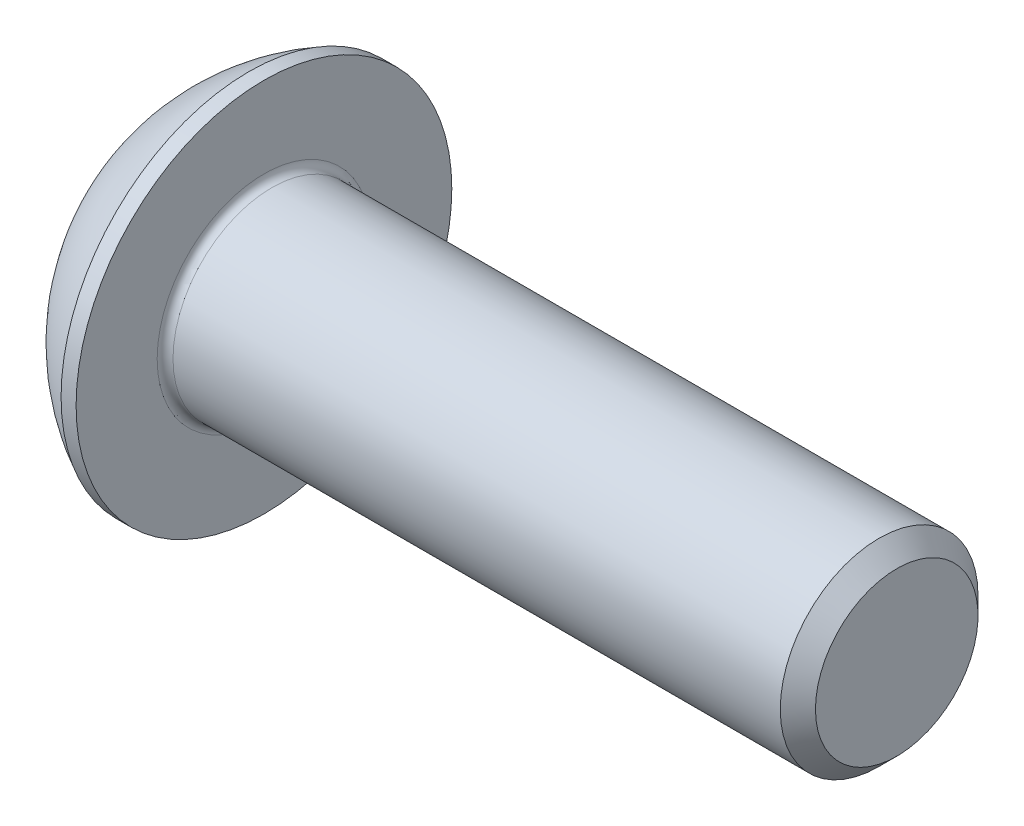
ISO-10303-21;
HEADER;
FILE_DESCRIPTION(('STEP AP214'),'2;1');
FILE_NAME('part.step','',(''),(''),'','','');
FILE_SCHEMA(('AUTOMOTIVE_DESIGN { 1 0 10303 214 1 1 1 1 }'));
ENDSEC;
DATA;
#1=APPLICATION_CONTEXT('core data for automotive mechanical design processes');
#2=APPLICATION_PROTOCOL_DEFINITION('international standard','automotive_design',2000,#1);
#3=PRODUCT_CONTEXT('',#1,'mechanical');
#4=PRODUCT('Part','Part','',(#3));
#5=PRODUCT_RELATED_PRODUCT_CATEGORY('part','',(#4));
#6=PRODUCT_DEFINITION_FORMATION('','',#4);
#7=PRODUCT_DEFINITION_CONTEXT('part definition',#1,'design');
#8=PRODUCT_DEFINITION('design','',#6,#7);
#9=PRODUCT_DEFINITION_SHAPE('','',#8);
#10=(LENGTH_UNIT() NAMED_UNIT(*) SI_UNIT(.MILLI.,.METRE.));
#11=(NAMED_UNIT(*) PLANE_ANGLE_UNIT() SI_UNIT($,.RADIAN.));
#12=(NAMED_UNIT(*) SI_UNIT($,.STERADIAN.) SOLID_ANGLE_UNIT());
#13=UNCERTAINTY_MEASURE_WITH_UNIT(LENGTH_MEASURE(1.E-05),#10,'distance_accuracy_value','');
#14=(GEOMETRIC_REPRESENTATION_CONTEXT(3) GLOBAL_UNCERTAINTY_ASSIGNED_CONTEXT((#13)) GLOBAL_UNIT_ASSIGNED_CONTEXT((#10,
#11,#12)) REPRESENTATION_CONTEXT('',''));
#15=CARTESIAN_POINT('',(0.,0.,0.));
#16=DIRECTION('',(0.,0.,1.));
#17=DIRECTION('',(1.,0.,0.));
#18=AXIS2_PLACEMENT_3D('',#15,#16,#17);
#19=CARTESIAN_POINT('',(0.,0.,0.));
#20=DIRECTION('',(-1.,0.,0.));
#21=DIRECTION('',(0.,0.,1.));
#22=AXIS2_PLACEMENT_3D('',#19,#20,#21);
#23=PLANE('',#22);
#24=CARTESIAN_POINT('',(0.,0.,0.));
#25=DIRECTION('',(-1.,0.,0.));
#26=DIRECTION('',(0.,0.,1.));
#27=AXIS2_PLACEMENT_3D('',#24,#25,#26);
#28=CIRCLE('',#27,2.375);
#29=CARTESIAN_POINT('',(0.,0.,2.375));
#30=VERTEX_POINT('',#29);
#31=EDGE_CURVE('E157',#30,#30,#28,.T.);
#32=ORIENTED_EDGE('',*,*,#31,.T.);
#33=EDGE_LOOP('',(#32));
#34=FACE_BOUND('',#33,.T.);
#35=DIRECTION('',(0.,-1.,0.));
#36=VECTOR('',#35,1.);
#37=CARTESIAN_POINT('',(0.,-0.866025403784438,1.5));
#38=LINE('',#37,#36);
#39=CARTESIAN_POINT('',(0.,0.866025403784439,1.5));
#40=VERTEX_POINT('',#39);
#41=CARTESIAN_POINT('',(0.,-0.866025403784438,1.5));
#42=VERTEX_POINT('',#41);
#43=EDGE_CURVE('E52',#40,#42,#38,.T.);
#44=ORIENTED_EDGE('',*,*,#43,.T.);
#45=DIRECTION('',(0.,-0.500000000000001,-0.866025403784438));
#46=VECTOR('',#45,1.);
#47=CARTESIAN_POINT('',(0.,-1.73205080756888,0.));
#48=LINE('',#47,#46);
#49=CARTESIAN_POINT('',(0.,-1.73205080756888,0.));
#50=VERTEX_POINT('',#49);
#51=EDGE_CURVE('E277',#42,#50,#48,.T.);
#52=ORIENTED_EDGE('',*,*,#51,.T.);
#53=DIRECTION('',(0.,0.500000000000001,-0.866025403784438));
#54=VECTOR('',#53,1.);
#55=CARTESIAN_POINT('',(0.,-0.866025403784438,-1.5));
#56=LINE('',#55,#54);
#57=CARTESIAN_POINT('',(0.,-0.866025403784438,-1.5));
#58=VERTEX_POINT('',#57);
#59=EDGE_CURVE('E132',#50,#58,#56,.T.);
#60=ORIENTED_EDGE('',*,*,#59,.T.);
#61=DIRECTION('',(0.,1.,0.));
#62=VECTOR('',#61,1.);
#63=CARTESIAN_POINT('',(0.,0.866025403784439,-1.5));
#64=LINE('',#63,#62);
#65=CARTESIAN_POINT('',(0.,0.866025403784439,-1.5));
#66=VERTEX_POINT('',#65);
#67=EDGE_CURVE('E280',#58,#66,#64,.T.);
#68=ORIENTED_EDGE('',*,*,#67,.T.);
#69=DIRECTION('',(0.,0.5,0.866025403784439));
#70=VECTOR('',#69,1.);
#71=CARTESIAN_POINT('',(0.,1.73205080756888,0.));
#72=LINE('',#71,#70);
#73=CARTESIAN_POINT('',(0.,1.73205080756888,0.));
#74=VERTEX_POINT('',#73);
#75=EDGE_CURVE('E282',#66,#74,#72,.T.);
#76=ORIENTED_EDGE('',*,*,#75,.T.);
#77=DIRECTION('',(0.,-0.5,0.866025403784439));
#78=VECTOR('',#77,1.);
#79=CARTESIAN_POINT('',(0.,0.866025403784439,1.5));
#80=LINE('',#79,#78);
#81=EDGE_CURVE('E284',#74,#40,#80,.T.);
#82=ORIENTED_EDGE('',*,*,#81,.T.);
#83=EDGE_LOOP('',(#44,#52,#60,#68,#76,#82));
#84=FACE_BOUND('',#83,.T.);
#85=ADVANCED_FACE('F37',(#34,#84),#23,.T.);
#86=CARTESIAN_POINT('',(4.75501582278481,0.,0.));
#87=DIRECTION('',(-1.,0.,0.));
#88=DIRECTION('',(0.,1.,0.));
#89=AXIS2_PLACEMENT_3D('',#86,#87,#88);
#90=SPHERICAL_SURFACE('',#89,5.3151482081814);
#91=CARTESIAN_POINT('',(2.37,0.,0.));
#92=DIRECTION('',(-1.,0.,0.));
#93=DIRECTION('',(0.,0.,1.));
#94=AXIS2_PLACEMENT_3D('',#91,#92,#93);
#95=CIRCLE('',#94,4.75);
#96=CARTESIAN_POINT('',(2.37,0.,4.75));
#97=VERTEX_POINT('',#96);
#98=EDGE_CURVE('E154',#97,#97,#95,.T.);
#99=ORIENTED_EDGE('',*,*,#98,.T.);
#100=EDGE_LOOP('',(#99));
#101=FACE_BOUND('',#100,.T.);
#102=ORIENTED_EDGE('',*,*,#31,.F.);
#103=EDGE_LOOP('',(#102));
#104=FACE_BOUND('',#103,.T.);
#105=ADVANCED_FACE('F178',(#101,#104),#90,.T.);
#106=CARTESIAN_POINT('',(0.,0.,0.));
#107=DIRECTION('',(-1.,0.,0.));
#108=DIRECTION('',(0.,0.,1.));
#109=AXIS2_PLACEMENT_3D('',#106,#107,#108);
#110=CYLINDRICAL_SURFACE('',#109,4.75);
#111=ORIENTED_EDGE('',*,*,#98,.F.);
#112=EDGE_LOOP('',(#111));
#113=FACE_BOUND('',#112,.T.);
#114=CARTESIAN_POINT('',(2.75,0.,0.));
#115=DIRECTION('',(-1.,0.,0.));
#116=DIRECTION('',(0.,0.,1.));
#117=AXIS2_PLACEMENT_3D('',#114,#115,#116);
#118=CIRCLE('',#117,4.75);
#119=CARTESIAN_POINT('',(2.75,0.,4.75));
#120=VERTEX_POINT('',#119);
#121=EDGE_CURVE('E151',#120,#120,#118,.T.);
#122=ORIENTED_EDGE('',*,*,#121,.T.);
#123=EDGE_LOOP('',(#122));
#124=FACE_BOUND('',#123,.T.);
#125=ADVANCED_FACE('F183',(#113,#124),#110,.T.);
#126=CARTESIAN_POINT('',(2.75,2.5,0.));
#127=DIRECTION('',(-1.,0.,0.));
#128=DIRECTION('',(0.,0.,1.));
#129=AXIS2_PLACEMENT_3D('',#126,#127,#128);
#130=PLANE('',#129);
#131=CARTESIAN_POINT('',(2.75,0.,0.));
#132=DIRECTION('',(-1.,0.,0.));
#133=DIRECTION('',(0.,0.,1.));
#134=AXIS2_PLACEMENT_3D('',#131,#132,#133);
#135=CIRCLE('',#134,2.7);
#136=CARTESIAN_POINT('',(2.75,0.,2.7));
#137=VERTEX_POINT('',#136);
#138=EDGE_CURVE('E45',#137,#137,#135,.T.);
#139=ORIENTED_EDGE('',*,*,#138,.T.);
#140=EDGE_LOOP('',(#139));
#141=FACE_BOUND('',#140,.T.);
#142=ORIENTED_EDGE('',*,*,#121,.F.);
#143=EDGE_LOOP('',(#142));
#144=FACE_BOUND('',#143,.T.);
#145=ADVANCED_FACE('F162',(#141,#144),#130,.F.);
#146=CARTESIAN_POINT('',(0.,0.,0.));
#147=DIRECTION('',(-1.,0.,0.));
#148=DIRECTION('',(0.,0.,1.));
#149=AXIS2_PLACEMENT_3D('',#146,#147,#148);
#150=CYLINDRICAL_SURFACE('',#149,2.5);
#151=CARTESIAN_POINT('',(2.95,0.,0.));
#152=DIRECTION('',(-1.,0.,0.));
#153=DIRECTION('',(0.,0.,1.));
#154=AXIS2_PLACEMENT_3D('',#151,#152,#153);
#155=CIRCLE('',#154,2.5);
#156=CARTESIAN_POINT('',(2.95,0.,2.5));
#157=VERTEX_POINT('',#156);
#158=EDGE_CURVE('E11',#157,#157,#155,.F.);
#159=ORIENTED_EDGE('',*,*,#158,.T.);
#160=EDGE_LOOP('',(#159));
#161=FACE_BOUND('',#160,.T.);
#162=CARTESIAN_POINT('',(18.305,0.,0.));
#163=DIRECTION('',(-1.,0.,0.));
#164=DIRECTION('',(0.,0.,1.));
#165=AXIS2_PLACEMENT_3D('',#162,#163,#164);
#166=CIRCLE('',#165,2.5);
#167=CARTESIAN_POINT('',(18.305,0.,2.5));
#168=VERTEX_POINT('',#167);
#169=EDGE_CURVE('E148',#168,#168,#166,.T.);
#170=ORIENTED_EDGE('',*,*,#169,.T.);
#171=EDGE_LOOP('',(#170));
#172=FACE_BOUND('',#171,.T.);
#173=ADVANCED_FACE('F192',(#161,#172),#150,.T.);
#174=CARTESIAN_POINT('',(18.75,0.,0.));
#175=DIRECTION('',(-1.,0.,0.));
#176=DIRECTION('',(0.,0.,1.));
#177=AXIS2_PLACEMENT_3D('',#174,#175,#176);
#178=CONICAL_SURFACE('',#177,2.055,0.785398163397441);
#179=ORIENTED_EDGE('',*,*,#169,.F.);
#180=EDGE_LOOP('',(#179));
#181=FACE_BOUND('',#180,.T.);
#182=CARTESIAN_POINT('',(18.75,0.,0.));
#183=DIRECTION('',(-1.,0.,0.));
#184=DIRECTION('',(0.,0.,1.));
#185=AXIS2_PLACEMENT_3D('',#182,#183,#184);
#186=CIRCLE('',#185,2.055);
#187=CARTESIAN_POINT('',(18.75,0.,2.055));
#188=VERTEX_POINT('',#187);
#189=EDGE_CURVE('E144',#188,#188,#186,.T.);
#190=ORIENTED_EDGE('',*,*,#189,.T.);
#191=EDGE_LOOP('',(#190));
#192=FACE_BOUND('',#191,.T.);
#193=ADVANCED_FACE('F173',(#181,#192),#178,.T.);
#194=CARTESIAN_POINT('',(18.75,0.,0.));
#195=DIRECTION('',(-1.,0.,0.));
#196=DIRECTION('',(0.,0.,1.));
#197=AXIS2_PLACEMENT_3D('',#194,#195,#196);
#198=PLANE('',#197);
#199=ORIENTED_EDGE('',*,*,#189,.F.);
#200=EDGE_LOOP('',(#199));
#201=FACE_BOUND('',#200,.T.);
#202=ADVANCED_FACE('F166',(#201),#198,.F.);
#203=CARTESIAN_POINT('',(2.95,0.,0.));
#204=DIRECTION('',(-1.,0.,0.));
#205=DIRECTION('',(0.,0.,1.));
#206=AXIS2_PLACEMENT_3D('',#203,#204,#205);
#207=TOROIDAL_SURFACE('',#206,2.7,0.2);
#208=ORIENTED_EDGE('',*,*,#158,.F.);
#209=EDGE_LOOP('',(#208));
#210=FACE_BOUND('',#209,.T.);
#211=ORIENTED_EDGE('',*,*,#138,.F.);
#212=EDGE_LOOP('',(#211));
#213=FACE_BOUND('',#212,.T.);
#214=ADVANCED_FACE('F39',(#210,#213),#207,.F.);
#215=CARTESIAN_POINT('',(1.56,-1.73205080756888,0.));
#216=DIRECTION('',(0.,0.866025403784438,-0.500000000000001));
#217=DIRECTION('',(0.,0.500000000000001,0.866025403784438));
#218=AXIS2_PLACEMENT_3D('',#215,#216,#217);
#219=PLANE('',#218);
#220=DIRECTION('',(0.,-0.500000000000001,-0.866025403784438));
#221=VECTOR('',#220,1.);
#222=CARTESIAN_POINT('',(1.56,-1.73205080756888,0.));
#223=LINE('',#222,#221);
#224=CARTESIAN_POINT('',(1.56,-0.866025403784438,1.5));
#225=VERTEX_POINT('',#224);
#226=CARTESIAN_POINT('',(1.56,-1.29903810567666,0.750000000000002));
#227=VERTEX_POINT('',#226);
#228=EDGE_CURVE('E118',#225,#227,#223,.T.);
#229=ORIENTED_EDGE('',*,*,#228,.T.);
#230=CARTESIAN_POINT('',(1.56,-1.73205080756888,0.));
#231=VERTEX_POINT('',#230);
#232=EDGE_CURVE('E113',#227,#231,#223,.T.);
#233=ORIENTED_EDGE('',*,*,#232,.T.);
#234=DIRECTION('',(-1.,0.,0.));
#235=VECTOR('',#234,1.);
#236=CARTESIAN_POINT('',(1.56,-1.73205080756888,0.));
#237=LINE('',#236,#235);
#238=EDGE_CURVE('E115',#231,#50,#237,.T.);
#239=ORIENTED_EDGE('',*,*,#238,.T.);
#240=ORIENTED_EDGE('',*,*,#51,.F.);
#241=DIRECTION('',(-1.,0.,0.));
#242=VECTOR('',#241,1.);
#243=CARTESIAN_POINT('',(1.56,-0.866025403784438,1.5));
#244=LINE('',#243,#242);
#245=EDGE_CURVE('E273',#225,#42,#244,.T.);
#246=ORIENTED_EDGE('',*,*,#245,.F.);
#247=EDGE_LOOP('',(#229,#233,#239,#240,#246));
#248=FACE_BOUND('',#247,.T.);
#249=ADVANCED_FACE('F114',(#248),#219,.T.);
#250=CARTESIAN_POINT('',(1.56,-0.866025403784438,-1.5));
#251=DIRECTION('',(0.,0.866025403784438,0.500000000000001));
#252=DIRECTION('',(0.,-0.500000000000001,0.866025403784438));
#253=AXIS2_PLACEMENT_3D('',#250,#251,#252);
#254=PLANE('',#253);
#255=DIRECTION('',(0.,0.500000000000001,-0.866025403784438));
#256=VECTOR('',#255,1.);
#257=CARTESIAN_POINT('',(1.56,-0.866025403784438,-1.5));
#258=LINE('',#257,#256);
#259=CARTESIAN_POINT('',(1.56,-1.29903810567666,-0.750000000000001));
#260=VERTEX_POINT('',#259);
#261=EDGE_CURVE('E60',#231,#260,#258,.T.);
#262=ORIENTED_EDGE('',*,*,#261,.T.);
#263=CARTESIAN_POINT('',(1.56,-0.866025403784438,-1.5));
#264=VERTEX_POINT('',#263);
#265=EDGE_CURVE('E127',#260,#264,#258,.T.);
#266=ORIENTED_EDGE('',*,*,#265,.T.);
#267=DIRECTION('',(-1.,0.,0.));
#268=VECTOR('',#267,1.);
#269=CARTESIAN_POINT('',(1.56,-0.866025403784438,-1.5));
#270=LINE('',#269,#268);
#271=EDGE_CURVE('E134',#264,#58,#270,.T.);
#272=ORIENTED_EDGE('',*,*,#271,.T.);
#273=ORIENTED_EDGE('',*,*,#59,.F.);
#274=ORIENTED_EDGE('',*,*,#238,.F.);
#275=EDGE_LOOP('',(#262,#266,#272,#273,#274));
#276=FACE_BOUND('',#275,.T.);
#277=ADVANCED_FACE('F130',(#276),#254,.T.);
#278=CARTESIAN_POINT('',(1.56,0.866025403784439,-1.5));
#279=DIRECTION('',(0.,0.,1.));
#280=DIRECTION('',(1.,0.,0.));
#281=AXIS2_PLACEMENT_3D('',#278,#279,#280);
#282=PLANE('',#281);
#283=DIRECTION('',(0.,1.,0.));
#284=VECTOR('',#283,1.);
#285=CARTESIAN_POINT('',(1.56,0.866025403784439,-1.5));
#286=LINE('',#285,#284);
#287=CARTESIAN_POINT('',(1.56,0.,-1.5));
#288=VERTEX_POINT('',#287);
#289=EDGE_CURVE('E254',#264,#288,#286,.T.);
#290=ORIENTED_EDGE('',*,*,#289,.T.);
#291=CARTESIAN_POINT('',(1.56,0.866025403784439,-1.5));
#292=VERTEX_POINT('',#291);
#293=EDGE_CURVE('E126',#288,#292,#286,.T.);
#294=ORIENTED_EDGE('',*,*,#293,.T.);
#295=DIRECTION('',(-1.,0.,0.));
#296=VECTOR('',#295,1.);
#297=CARTESIAN_POINT('',(1.56,0.866025403784439,-1.5));
#298=LINE('',#297,#296);
#299=EDGE_CURVE('E139',#292,#66,#298,.T.);
#300=ORIENTED_EDGE('',*,*,#299,.T.);
#301=ORIENTED_EDGE('',*,*,#67,.F.);
#302=ORIENTED_EDGE('',*,*,#271,.F.);
#303=EDGE_LOOP('',(#290,#294,#300,#301,#302));
#304=FACE_BOUND('',#303,.T.);
#305=ADVANCED_FACE('F206',(#304),#282,.T.);
#306=CARTESIAN_POINT('',(1.56,1.73205080756888,0.));
#307=DIRECTION('',(0.,-0.866025403784439,0.5));
#308=DIRECTION('',(0.,-0.5,-0.866025403784439));
#309=AXIS2_PLACEMENT_3D('',#306,#307,#308);
#310=PLANE('',#309);
#311=DIRECTION('',(0.,0.5,0.866025403784439));
#312=VECTOR('',#311,1.);
#313=CARTESIAN_POINT('',(1.56,1.73205080756888,0.));
#314=LINE('',#313,#312);
#315=CARTESIAN_POINT('',(1.56,1.29903810567666,-0.75));
#316=VERTEX_POINT('',#315);
#317=EDGE_CURVE('E243',#292,#316,#314,.T.);
#318=ORIENTED_EDGE('',*,*,#317,.T.);
#319=CARTESIAN_POINT('',(1.56,1.73205080756888,0.));
#320=VERTEX_POINT('',#319);
#321=EDGE_CURVE('E248',#316,#320,#314,.T.);
#322=ORIENTED_EDGE('',*,*,#321,.T.);
#323=DIRECTION('',(-1.,0.,0.));
#324=VECTOR('',#323,1.);
#325=CARTESIAN_POINT('',(1.56,1.73205080756888,0.));
#326=LINE('',#325,#324);
#327=EDGE_CURVE('E288',#320,#74,#326,.T.);
#328=ORIENTED_EDGE('',*,*,#327,.T.);
#329=ORIENTED_EDGE('',*,*,#75,.F.);
#330=ORIENTED_EDGE('',*,*,#299,.F.);
#331=EDGE_LOOP('',(#318,#322,#328,#329,#330));
#332=FACE_BOUND('',#331,.T.);
#333=ADVANCED_FACE('F209',(#332),#310,.T.);
#334=CARTESIAN_POINT('',(1.56,0.866025403784439,1.5));
#335=DIRECTION('',(0.,-0.866025403784439,-0.5));
#336=DIRECTION('',(0.,0.5,-0.866025403784439));
#337=AXIS2_PLACEMENT_3D('',#334,#335,#336);
#338=PLANE('',#337);
#339=DIRECTION('',(0.,-0.5,0.866025403784439));
#340=VECTOR('',#339,1.);
#341=CARTESIAN_POINT('',(1.56,0.866025403784439,1.5));
#342=LINE('',#341,#340);
#343=CARTESIAN_POINT('',(1.56,1.29903810567666,0.75));
#344=VERTEX_POINT('',#343);
#345=EDGE_CURVE('E251',#320,#344,#342,.T.);
#346=ORIENTED_EDGE('',*,*,#345,.T.);
#347=CARTESIAN_POINT('',(1.56,0.866025403784439,1.5));
#348=VERTEX_POINT('',#347);
#349=EDGE_CURVE('E259',#344,#348,#342,.T.);
#350=ORIENTED_EDGE('',*,*,#349,.T.);
#351=DIRECTION('',(-1.,0.,0.));
#352=VECTOR('',#351,1.);
#353=CARTESIAN_POINT('',(1.56,0.866025403784439,1.5));
#354=LINE('',#353,#352);
#355=EDGE_CURVE('E272',#348,#40,#354,.T.);
#356=ORIENTED_EDGE('',*,*,#355,.T.);
#357=ORIENTED_EDGE('',*,*,#81,.F.);
#358=ORIENTED_EDGE('',*,*,#327,.F.);
#359=EDGE_LOOP('',(#346,#350,#356,#357,#358));
#360=FACE_BOUND('',#359,.T.);
#361=ADVANCED_FACE('F213',(#360),#338,.T.);
#362=CARTESIAN_POINT('',(1.56,-0.866025403784438,1.5));
#363=DIRECTION('',(0.,0.,-1.));
#364=DIRECTION('',(-1.,0.,0.));
#365=AXIS2_PLACEMENT_3D('',#362,#363,#364);
#366=PLANE('',#365);
#367=DIRECTION('',(0.,-1.,0.));
#368=VECTOR('',#367,1.);
#369=CARTESIAN_POINT('',(1.56,-0.866025403784438,1.5));
#370=LINE('',#369,#368);
#371=CARTESIAN_POINT('',(1.56,0.,1.5));
#372=VERTEX_POINT('',#371);
#373=EDGE_CURVE('E265',#348,#372,#370,.T.);
#374=ORIENTED_EDGE('',*,*,#373,.T.);
#375=EDGE_CURVE('E267',#372,#225,#370,.T.);
#376=ORIENTED_EDGE('',*,*,#375,.T.);
#377=ORIENTED_EDGE('',*,*,#245,.T.);
#378=ORIENTED_EDGE('',*,*,#43,.F.);
#379=ORIENTED_EDGE('',*,*,#355,.F.);
#380=EDGE_LOOP('',(#374,#376,#377,#378,#379));
#381=FACE_BOUND('',#380,.T.);
#382=ADVANCED_FACE('F217',(#381),#366,.T.);
#383=CARTESIAN_POINT('',(1.56,-1.73205080756888,0.));
#384=DIRECTION('',(1.,0.,0.));
#385=DIRECTION('',(0.,0.,-1.));
#386=AXIS2_PLACEMENT_3D('',#383,#384,#385);
#387=PLANE('',#386);
#388=CARTESIAN_POINT('',(1.56,0.,0.));
#389=DIRECTION('',(-1.,0.,0.));
#390=DIRECTION('',(0.,0.,1.));
#391=AXIS2_PLACEMENT_3D('',#388,#389,#390);
#392=CIRCLE('',#391,1.5);
#393=EDGE_CURVE('E240',#316,#288,#392,.T.);
#394=ORIENTED_EDGE('',*,*,#393,.F.);
#395=ORIENTED_EDGE('',*,*,#317,.F.);
#396=ORIENTED_EDGE('',*,*,#293,.F.);
#397=EDGE_LOOP('',(#394,#395,#396));
#398=FACE_BOUND('',#397,.T.);
#399=ADVANCED_FACE('F221',(#398),#387,.F.);
#400=EDGE_CURVE('E145',#344,#316,#392,.T.);
#401=ORIENTED_EDGE('',*,*,#400,.F.);
#402=ORIENTED_EDGE('',*,*,#345,.F.);
#403=ORIENTED_EDGE('',*,*,#321,.F.);
#404=EDGE_LOOP('',(#401,#402,#403));
#405=FACE_BOUND('',#404,.T.);
#406=ADVANCED_FACE('F230',(#405),#387,.F.);
#407=EDGE_CURVE('E138',#372,#344,#392,.T.);
#408=ORIENTED_EDGE('',*,*,#407,.F.);
#409=ORIENTED_EDGE('',*,*,#373,.F.);
#410=ORIENTED_EDGE('',*,*,#349,.F.);
#411=EDGE_LOOP('',(#408,#409,#410));
#412=FACE_BOUND('',#411,.T.);
#413=ADVANCED_FACE('F235',(#412),#387,.F.);
#414=EDGE_CURVE('E133',#227,#372,#392,.T.);
#415=ORIENTED_EDGE('',*,*,#414,.F.);
#416=ORIENTED_EDGE('',*,*,#228,.F.);
#417=ORIENTED_EDGE('',*,*,#375,.F.);
#418=EDGE_LOOP('',(#415,#416,#417));
#419=FACE_BOUND('',#418,.T.);
#420=ADVANCED_FACE('F228',(#419),#387,.F.);
#421=EDGE_CURVE('E124',#260,#227,#392,.T.);
#422=ORIENTED_EDGE('',*,*,#421,.F.);
#423=ORIENTED_EDGE('',*,*,#261,.F.);
#424=ORIENTED_EDGE('',*,*,#232,.F.);
#425=EDGE_LOOP('',(#422,#423,#424));
#426=FACE_BOUND('',#425,.T.);
#427=ADVANCED_FACE('F123',(#426),#387,.F.);
#428=EDGE_CURVE('E246',#288,#260,#392,.T.);
#429=ORIENTED_EDGE('',*,*,#428,.F.);
#430=ORIENTED_EDGE('',*,*,#289,.F.);
#431=ORIENTED_EDGE('',*,*,#265,.F.);
#432=EDGE_LOOP('',(#429,#430,#431));
#433=FACE_BOUND('',#432,.T.);
#434=ADVANCED_FACE('F201',(#433),#387,.F.);
#435=CARTESIAN_POINT('',(2.42602540378445,0.,0.));
#436=DIRECTION('',(-1.,0.,0.));
#437=DIRECTION('',(0.,0.,1.));
#438=AXIS2_PLACEMENT_3D('',#435,#436,#437);
#439=CONICAL_SURFACE('',#438,0.,1.04719755119659);
#440=ORIENTED_EDGE('',*,*,#407,.T.);
#441=ORIENTED_EDGE('',*,*,#400,.T.);
#442=ORIENTED_EDGE('',*,*,#393,.T.);
#443=ORIENTED_EDGE('',*,*,#428,.T.);
#444=ORIENTED_EDGE('',*,*,#421,.T.);
#445=ORIENTED_EDGE('',*,*,#414,.T.);
#446=EDGE_LOOP('',(#440,#441,#442,#443,#444,#445));
#447=FACE_BOUND('',#446,.T.);
#448=CARTESIAN_POINT('',(2.42602540378445,0.,0.));
#449=VERTEX_POINT('',#448);
#450=VERTEX_LOOP('',#449);
#451=FACE_BOUND('',#450,.T.);
#452=ADVANCED_FACE('F199',(#447,#451),#439,.F.);
#453=CLOSED_SHELL('',(#85,#105,#125,#145,#173,#193,#202,#214,#249,#277,#305,#333,#361,#382,#399,
#406,#413,#420,#427,#434,#452));
#454=MANIFOLD_SOLID_BREP('B2',#453);
#455=ADVANCED_BREP_SHAPE_REPRESENTATION('',(#18,#454),#14);
#456=SHAPE_DEFINITION_REPRESENTATION(#9,#455);
ENDSEC;
END-ISO-10303-21;
